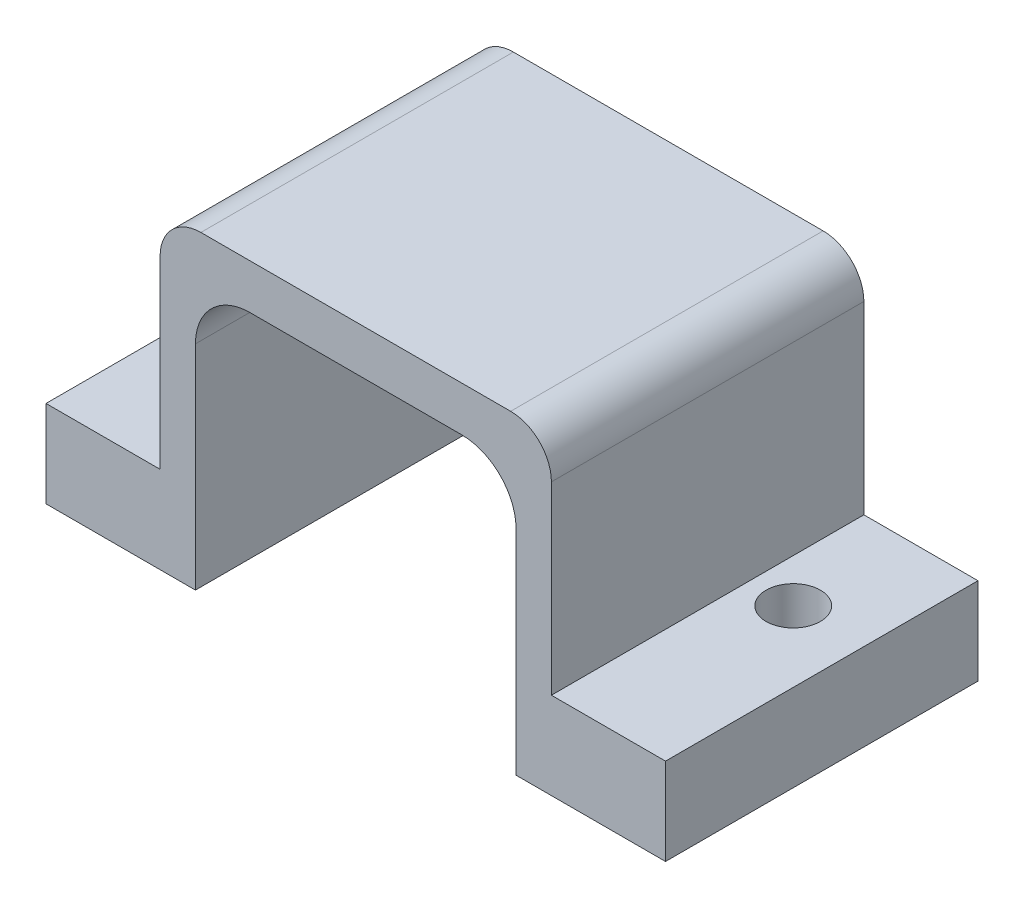
ISO-10303-21;
HEADER;
FILE_DESCRIPTION(('STEP AP214'),'2;1');
FILE_NAME('part.step','',(''),(''),'','','');
FILE_SCHEMA(('AUTOMOTIVE_DESIGN { 1 0 10303 214 1 1 1 1 }'));
ENDSEC;
DATA;
#1=APPLICATION_CONTEXT('core data for automotive mechanical design processes');
#2=APPLICATION_PROTOCOL_DEFINITION('international standard','automotive_design',2000,#1);
#3=PRODUCT_CONTEXT('',#1,'mechanical');
#4=PRODUCT('Part','Part','',(#3));
#5=PRODUCT_RELATED_PRODUCT_CATEGORY('part','',(#4));
#6=PRODUCT_DEFINITION_FORMATION('','',#4);
#7=PRODUCT_DEFINITION_CONTEXT('part definition',#1,'design');
#8=PRODUCT_DEFINITION('design','',#6,#7);
#9=PRODUCT_DEFINITION_SHAPE('','',#8);
#10=(LENGTH_UNIT() NAMED_UNIT(*) SI_UNIT(.MILLI.,.METRE.));
#11=(NAMED_UNIT(*) PLANE_ANGLE_UNIT() SI_UNIT($,.RADIAN.));
#12=(NAMED_UNIT(*) SI_UNIT($,.STERADIAN.) SOLID_ANGLE_UNIT());
#13=UNCERTAINTY_MEASURE_WITH_UNIT(LENGTH_MEASURE(1.E-05),#10,'distance_accuracy_value','');
#14=(GEOMETRIC_REPRESENTATION_CONTEXT(3) GLOBAL_UNCERTAINTY_ASSIGNED_CONTEXT((#13)) GLOBAL_UNIT_ASSIGNED_CONTEXT((#10,
#11,#12)) REPRESENTATION_CONTEXT('',''));
#15=CARTESIAN_POINT('',(0.,0.,0.));
#16=DIRECTION('',(0.,0.,1.));
#17=DIRECTION('',(1.,0.,0.));
#18=AXIS2_PLACEMENT_3D('',#15,#16,#17);
#19=CARTESIAN_POINT('',(-5.5,0.,11.5));
#20=DIRECTION('',(0.,1.,0.));
#21=DIRECTION('',(0.,0.,1.));
#22=AXIS2_PLACEMENT_3D('',#19,#20,#21);
#23=PLANE('',#22);
#24=CARTESIAN_POINT('',(-2.9,0.,4.2));
#25=DIRECTION('',(0.,1.,0.));
#26=DIRECTION('',(0.,0.,1.));
#27=AXIS2_PLACEMENT_3D('',#24,#25,#26);
#28=CIRCLE('',#27,1.);
#29=CARTESIAN_POINT('',(-2.9,0.,5.2));
#30=VERTEX_POINT('',#29);
#31=EDGE_CURVE('E294',#30,#30,#28,.T.);
#32=ORIENTED_EDGE('',*,*,#31,.T.);
#33=EDGE_LOOP('',(#32));
#34=FACE_BOUND('',#33,.T.);
#35=DIRECTION('',(1.,0.,0.));
#36=VECTOR('',#35,1.);
#37=CARTESIAN_POINT('',(-5.5,0.,0.));
#38=LINE('',#37,#36);
#39=CARTESIAN_POINT('',(-5.5,0.,0.));
#40=VERTEX_POINT('',#39);
#41=CARTESIAN_POINT('',(0.,0.,0.));
#42=VERTEX_POINT('',#41);
#43=EDGE_CURVE('E172',#40,#42,#38,.T.);
#44=ORIENTED_EDGE('',*,*,#43,.T.);
#45=DIRECTION('',(0.,0.,-1.));
#46=VECTOR('',#45,1.);
#47=CARTESIAN_POINT('',(0.,0.,11.5));
#48=LINE('',#47,#46);
#49=CARTESIAN_POINT('',(0.,0.,11.5));
#50=VERTEX_POINT('',#49);
#51=EDGE_CURVE('E154',#50,#42,#48,.T.);
#52=ORIENTED_EDGE('',*,*,#51,.F.);
#53=DIRECTION('',(1.,0.,0.));
#54=VECTOR('',#53,1.);
#55=CARTESIAN_POINT('',(-5.5,0.,11.5));
#56=LINE('',#55,#54);
#57=CARTESIAN_POINT('',(-5.5,0.,11.5));
#58=VERTEX_POINT('',#57);
#59=EDGE_CURVE('E160',#58,#50,#56,.T.);
#60=ORIENTED_EDGE('',*,*,#59,.F.);
#61=DIRECTION('',(0.,0.,-1.));
#62=VECTOR('',#61,1.);
#63=CARTESIAN_POINT('',(-5.5,0.,11.5));
#64=LINE('',#63,#62);
#65=EDGE_CURVE('E243',#58,#40,#64,.T.);
#66=ORIENTED_EDGE('',*,*,#65,.T.);
#67=EDGE_LOOP('',(#44,#52,#60,#66));
#68=FACE_BOUND('',#67,.T.);
#69=ADVANCED_FACE('F33',(#34,#68),#23,.F.);
#70=CARTESIAN_POINT('',(0.,0.,11.5));
#71=DIRECTION('',(-1.,0.,0.));
#72=DIRECTION('',(0.,0.,1.));
#73=AXIS2_PLACEMENT_3D('',#70,#71,#72);
#74=PLANE('',#73);
#75=DIRECTION('',(0.,1.,0.));
#76=VECTOR('',#75,1.);
#77=CARTESIAN_POINT('',(0.,0.,0.));
#78=LINE('',#77,#76);
#79=CARTESIAN_POINT('',(0.,7.85,0.));
#80=VERTEX_POINT('',#79);
#81=EDGE_CURVE('E274',#42,#80,#78,.T.);
#82=ORIENTED_EDGE('',*,*,#81,.T.);
#83=DIRECTION('',(0.,0.,-1.));
#84=VECTOR('',#83,1.);
#85=CARTESIAN_POINT('',(0.,7.85,11.5));
#86=LINE('',#85,#84);
#87=CARTESIAN_POINT('',(0.,7.85,11.5));
#88=VERTEX_POINT('',#87);
#89=EDGE_CURVE('E157',#80,#88,#86,.F.);
#90=ORIENTED_EDGE('',*,*,#89,.T.);
#91=DIRECTION('',(0.,1.,0.));
#92=VECTOR('',#91,1.);
#93=CARTESIAN_POINT('',(0.,0.,11.5));
#94=LINE('',#93,#92);
#95=EDGE_CURVE('E149',#50,#88,#94,.T.);
#96=ORIENTED_EDGE('',*,*,#95,.F.);
#97=ORIENTED_EDGE('',*,*,#51,.T.);
#98=EDGE_LOOP('',(#82,#90,#96,#97));
#99=FACE_BOUND('',#98,.T.);
#100=ADVANCED_FACE('F152',(#99),#74,.F.);
#101=CARTESIAN_POINT('',(0.,9.85,11.5));
#102=DIRECTION('',(0.,1.,0.));
#103=DIRECTION('',(0.,0.,1.));
#104=AXIS2_PLACEMENT_3D('',#101,#102,#103);
#105=PLANE('',#104);
#106=DIRECTION('',(1.,0.,0.));
#107=VECTOR('',#106,1.);
#108=CARTESIAN_POINT('',(0.,9.85,0.));
#109=LINE('',#108,#107);
#110=CARTESIAN_POINT('',(2.,9.85,0.));
#111=VERTEX_POINT('',#110);
#112=CARTESIAN_POINT('',(9.8,9.85,0.));
#113=VERTEX_POINT('',#112);
#114=EDGE_CURVE('E271',#111,#113,#109,.T.);
#115=ORIENTED_EDGE('',*,*,#114,.T.);
#116=DIRECTION('',(0.,0.,-1.));
#117=VECTOR('',#116,1.);
#118=CARTESIAN_POINT('',(9.8,9.85,11.5));
#119=LINE('',#118,#117);
#120=CARTESIAN_POINT('',(9.8,9.85,11.5));
#121=VERTEX_POINT('',#120);
#122=EDGE_CURVE('E186',#113,#121,#119,.F.);
#123=ORIENTED_EDGE('',*,*,#122,.T.);
#124=DIRECTION('',(1.,0.,0.));
#125=VECTOR('',#124,1.);
#126=CARTESIAN_POINT('',(0.,9.85,11.5));
#127=LINE('',#126,#125);
#128=CARTESIAN_POINT('',(2.,9.85,11.5));
#129=VERTEX_POINT('',#128);
#130=EDGE_CURVE('E159',#129,#121,#127,.T.);
#131=ORIENTED_EDGE('',*,*,#130,.F.);
#132=DIRECTION('',(0.,0.,-1.));
#133=VECTOR('',#132,1.);
#134=CARTESIAN_POINT('',(2.,9.85,0.));
#135=LINE('',#134,#133);
#136=EDGE_CURVE('E177',#129,#111,#135,.T.);
#137=ORIENTED_EDGE('',*,*,#136,.T.);
#138=EDGE_LOOP('',(#115,#123,#131,#137));
#139=FACE_BOUND('',#138,.T.);
#140=ADVANCED_FACE('F327',(#139),#105,.F.);
#141=CARTESIAN_POINT('',(11.8,9.85,11.5));
#142=DIRECTION('',(1.,0.,0.));
#143=DIRECTION('',(0.,0.,-1.));
#144=AXIS2_PLACEMENT_3D('',#141,#142,#143);
#145=PLANE('',#144);
#146=DIRECTION('',(0.,-1.,0.));
#147=VECTOR('',#146,1.);
#148=CARTESIAN_POINT('',(11.8,9.85,11.5));
#149=LINE('',#148,#147);
#150=CARTESIAN_POINT('',(11.8,7.85,11.5));
#151=VERTEX_POINT('',#150);
#152=CARTESIAN_POINT('',(11.8,0.,11.5));
#153=VERTEX_POINT('',#152);
#154=EDGE_CURVE('E288',#151,#153,#149,.T.);
#155=ORIENTED_EDGE('',*,*,#154,.F.);
#156=DIRECTION('',(0.,0.,-1.));
#157=VECTOR('',#156,1.);
#158=CARTESIAN_POINT('',(11.8,7.85,0.));
#159=LINE('',#158,#157);
#160=CARTESIAN_POINT('',(11.8,7.85,0.));
#161=VERTEX_POINT('',#160);
#162=EDGE_CURVE('E173',#151,#161,#159,.T.);
#163=ORIENTED_EDGE('',*,*,#162,.T.);
#164=DIRECTION('',(0.,-1.,0.));
#165=VECTOR('',#164,1.);
#166=CARTESIAN_POINT('',(11.8,9.85,0.));
#167=LINE('',#166,#165);
#168=CARTESIAN_POINT('',(11.8,0.,0.));
#169=VERTEX_POINT('',#168);
#170=EDGE_CURVE('E267',#161,#169,#167,.T.);
#171=ORIENTED_EDGE('',*,*,#170,.T.);
#172=DIRECTION('',(0.,0.,-1.));
#173=VECTOR('',#172,1.);
#174=CARTESIAN_POINT('',(11.8,0.,11.5));
#175=LINE('',#174,#173);
#176=EDGE_CURVE('E174',#153,#169,#175,.T.);
#177=ORIENTED_EDGE('',*,*,#176,.F.);
#178=EDGE_LOOP('',(#155,#163,#171,#177));
#179=FACE_BOUND('',#178,.T.);
#180=ADVANCED_FACE('F335',(#179),#145,.F.);
#181=CARTESIAN_POINT('',(11.8,0.,11.5));
#182=DIRECTION('',(0.,1.,0.));
#183=DIRECTION('',(0.,0.,1.));
#184=AXIS2_PLACEMENT_3D('',#181,#182,#183);
#185=PLANE('',#184);
#186=CARTESIAN_POINT('',(14.7,0.,4.2));
#187=DIRECTION('',(0.,1.,0.));
#188=DIRECTION('',(0.,0.,1.));
#189=AXIS2_PLACEMENT_3D('',#186,#187,#188);
#190=CIRCLE('',#189,1.);
#191=CARTESIAN_POINT('',(14.7,0.,5.2));
#192=VERTEX_POINT('',#191);
#193=EDGE_CURVE('E277',#192,#192,#190,.T.);
#194=ORIENTED_EDGE('',*,*,#193,.T.);
#195=EDGE_LOOP('',(#194));
#196=FACE_BOUND('',#195,.T.);
#197=DIRECTION('',(1.,0.,0.));
#198=VECTOR('',#197,1.);
#199=CARTESIAN_POINT('',(11.8,0.,0.));
#200=LINE('',#199,#198);
#201=CARTESIAN_POINT('',(17.3,0.,0.));
#202=VERTEX_POINT('',#201);
#203=EDGE_CURVE('E266',#169,#202,#200,.T.);
#204=ORIENTED_EDGE('',*,*,#203,.T.);
#205=DIRECTION('',(0.,0.,-1.));
#206=VECTOR('',#205,1.);
#207=CARTESIAN_POINT('',(17.3,0.,11.5));
#208=LINE('',#207,#206);
#209=CARTESIAN_POINT('',(17.3,0.,11.5));
#210=VERTEX_POINT('',#209);
#211=EDGE_CURVE('E180',#210,#202,#208,.T.);
#212=ORIENTED_EDGE('',*,*,#211,.F.);
#213=DIRECTION('',(1.,0.,0.));
#214=VECTOR('',#213,1.);
#215=CARTESIAN_POINT('',(11.8,0.,11.5));
#216=LINE('',#215,#214);
#217=EDGE_CURVE('E286',#153,#210,#216,.T.);
#218=ORIENTED_EDGE('',*,*,#217,.F.);
#219=ORIENTED_EDGE('',*,*,#176,.T.);
#220=EDGE_LOOP('',(#204,#212,#218,#219));
#221=FACE_BOUND('',#220,.T.);
#222=ADVANCED_FACE('F336',(#196,#221),#185,.F.);
#223=CARTESIAN_POINT('',(17.3,0.,11.5));
#224=DIRECTION('',(-1.,0.,0.));
#225=DIRECTION('',(0.,0.,1.));
#226=AXIS2_PLACEMENT_3D('',#223,#224,#225);
#227=PLANE('',#226);
#228=DIRECTION('',(0.,1.,0.));
#229=VECTOR('',#228,1.);
#230=CARTESIAN_POINT('',(17.3,0.,0.));
#231=LINE('',#230,#229);
#232=CARTESIAN_POINT('',(17.3,3.2,0.));
#233=VERTEX_POINT('',#232);
#234=EDGE_CURVE('E235',#202,#233,#231,.T.);
#235=ORIENTED_EDGE('',*,*,#234,.T.);
#236=DIRECTION('',(0.,0.,-1.));
#237=VECTOR('',#236,1.);
#238=CARTESIAN_POINT('',(17.3,3.2,11.5));
#239=LINE('',#238,#237);
#240=CARTESIAN_POINT('',(17.3,3.2,11.5));
#241=VERTEX_POINT('',#240);
#242=EDGE_CURVE('E252',#241,#233,#239,.T.);
#243=ORIENTED_EDGE('',*,*,#242,.F.);
#244=DIRECTION('',(0.,1.,0.));
#245=VECTOR('',#244,1.);
#246=CARTESIAN_POINT('',(17.3,0.,11.5));
#247=LINE('',#246,#245);
#248=EDGE_CURVE('E261',#210,#241,#247,.T.);
#249=ORIENTED_EDGE('',*,*,#248,.F.);
#250=ORIENTED_EDGE('',*,*,#211,.T.);
#251=EDGE_LOOP('',(#235,#243,#249,#250));
#252=FACE_BOUND('',#251,.T.);
#253=ADVANCED_FACE('F259',(#252),#227,.F.);
#254=CARTESIAN_POINT('',(17.3,3.2,11.5));
#255=DIRECTION('',(0.,-1.,0.));
#256=DIRECTION('',(1.,0.,0.));
#257=AXIS2_PLACEMENT_3D('',#254,#255,#256);
#258=PLANE('',#257);
#259=CARTESIAN_POINT('',(14.7,3.2,4.2));
#260=DIRECTION('',(0.,1.,0.));
#261=DIRECTION('',(-1.,0.,0.));
#262=AXIS2_PLACEMENT_3D('',#259,#260,#261);
#263=CIRCLE('',#262,1.);
#264=CARTESIAN_POINT('',(13.7,3.2,4.2));
#265=VERTEX_POINT('',#264);
#266=EDGE_CURVE('E298',#265,#265,#263,.T.);
#267=ORIENTED_EDGE('',*,*,#266,.F.);
#268=EDGE_LOOP('',(#267));
#269=FACE_BOUND('',#268,.T.);
#270=DIRECTION('',(-1.,0.,0.));
#271=VECTOR('',#270,1.);
#272=CARTESIAN_POINT('',(17.3,3.2,0.));
#273=LINE('',#272,#271);
#274=CARTESIAN_POINT('',(13.1,3.2,0.));
#275=VERTEX_POINT('',#274);
#276=EDGE_CURVE('E231',#233,#275,#273,.T.);
#277=ORIENTED_EDGE('',*,*,#276,.T.);
#278=DIRECTION('',(0.,0.,-1.));
#279=VECTOR('',#278,1.);
#280=CARTESIAN_POINT('',(13.1,3.2,11.5));
#281=LINE('',#280,#279);
#282=CARTESIAN_POINT('',(13.1,3.2,11.5));
#283=VERTEX_POINT('',#282);
#284=EDGE_CURVE('E230',#283,#275,#281,.T.);
#285=ORIENTED_EDGE('',*,*,#284,.F.);
#286=DIRECTION('',(-1.,0.,0.));
#287=VECTOR('',#286,1.);
#288=CARTESIAN_POINT('',(17.3,3.2,11.5));
#289=LINE('',#288,#287);
#290=EDGE_CURVE('E283',#241,#283,#289,.T.);
#291=ORIENTED_EDGE('',*,*,#290,.F.);
#292=ORIENTED_EDGE('',*,*,#242,.T.);
#293=EDGE_LOOP('',(#277,#285,#291,#292));
#294=FACE_BOUND('',#293,.T.);
#295=ADVANCED_FACE('F339',(#269,#294),#258,.F.);
#296=CARTESIAN_POINT('',(13.1,3.2,11.5));
#297=DIRECTION('',(-1.,0.,0.));
#298=DIRECTION('',(0.,0.,1.));
#299=AXIS2_PLACEMENT_3D('',#296,#297,#298);
#300=PLANE('',#299);
#301=DIRECTION('',(0.,1.,0.));
#302=VECTOR('',#301,1.);
#303=CARTESIAN_POINT('',(13.1,3.2,0.));
#304=LINE('',#303,#302);
#305=CARTESIAN_POINT('',(13.1,10.,0.));
#306=VERTEX_POINT('',#305);
#307=EDGE_CURVE('E225',#275,#306,#304,.T.);
#308=ORIENTED_EDGE('',*,*,#307,.T.);
#309=DIRECTION('',(0.,0.,-1.));
#310=VECTOR('',#309,1.);
#311=CARTESIAN_POINT('',(13.1,10.,11.5));
#312=LINE('',#311,#310);
#313=CARTESIAN_POINT('',(13.1,10.,11.5));
#314=VERTEX_POINT('',#313);
#315=EDGE_CURVE('E56',#306,#314,#312,.F.);
#316=ORIENTED_EDGE('',*,*,#315,.T.);
#317=DIRECTION('',(0.,1.,0.));
#318=VECTOR('',#317,1.);
#319=CARTESIAN_POINT('',(13.1,3.2,11.5));
#320=LINE('',#319,#318);
#321=EDGE_CURVE('E210',#283,#314,#320,.T.);
#322=ORIENTED_EDGE('',*,*,#321,.F.);
#323=ORIENTED_EDGE('',*,*,#284,.T.);
#324=EDGE_LOOP('',(#308,#316,#322,#323));
#325=FACE_BOUND('',#324,.T.);
#326=ADVANCED_FACE('F228',(#325),#300,.F.);
#327=CARTESIAN_POINT('',(13.1,11.5,11.5));
#328=DIRECTION('',(0.,-1.,0.));
#329=DIRECTION('',(1.,0.,0.));
#330=AXIS2_PLACEMENT_3D('',#327,#328,#329);
#331=PLANE('',#330);
#332=DIRECTION('',(-1.,0.,0.));
#333=VECTOR('',#332,1.);
#334=CARTESIAN_POINT('',(13.1,11.5,11.5));
#335=LINE('',#334,#333);
#336=CARTESIAN_POINT('',(11.6,11.5,11.5));
#337=VERTEX_POINT('',#336);
#338=CARTESIAN_POINT('',(0.199999999999999,11.5,11.5));
#339=VERTEX_POINT('',#338);
#340=EDGE_CURVE('E209',#337,#339,#335,.T.);
#341=ORIENTED_EDGE('',*,*,#340,.F.);
#342=DIRECTION('',(0.,0.,-1.));
#343=VECTOR('',#342,1.);
#344=CARTESIAN_POINT('',(11.6,11.5,11.5));
#345=LINE('',#344,#343);
#346=CARTESIAN_POINT('',(11.6,11.5,0.));
#347=VERTEX_POINT('',#346);
#348=EDGE_CURVE('E199',#337,#347,#345,.T.);
#349=ORIENTED_EDGE('',*,*,#348,.T.);
#350=DIRECTION('',(-1.,0.,0.));
#351=VECTOR('',#350,1.);
#352=CARTESIAN_POINT('',(13.1,11.5,0.));
#353=LINE('',#352,#351);
#354=CARTESIAN_POINT('',(0.199999999999999,11.5,0.));
#355=VERTEX_POINT('',#354);
#356=EDGE_CURVE('E226',#347,#355,#353,.T.);
#357=ORIENTED_EDGE('',*,*,#356,.T.);
#358=DIRECTION('',(0.,0.,-1.));
#359=VECTOR('',#358,1.);
#360=CARTESIAN_POINT('',(0.199999999999999,11.5,11.5));
#361=LINE('',#360,#359);
#362=EDGE_CURVE('E197',#355,#339,#361,.F.);
#363=ORIENTED_EDGE('',*,*,#362,.T.);
#364=EDGE_LOOP('',(#341,#349,#357,#363));
#365=FACE_BOUND('',#364,.T.);
#366=ADVANCED_FACE('F214',(#365),#331,.F.);
#367=CARTESIAN_POINT('',(-1.3,11.5,11.5));
#368=DIRECTION('',(1.,0.,0.));
#369=DIRECTION('',(0.,1.,0.));
#370=AXIS2_PLACEMENT_3D('',#367,#368,#369);
#371=PLANE('',#370);
#372=DIRECTION('',(0.,-1.,0.));
#373=VECTOR('',#372,1.);
#374=CARTESIAN_POINT('',(-1.3,11.5,11.5));
#375=LINE('',#374,#373);
#376=CARTESIAN_POINT('',(-1.3,10.,11.5));
#377=VERTEX_POINT('',#376);
#378=CARTESIAN_POINT('',(-1.3,3.2,11.5));
#379=VERTEX_POINT('',#378);
#380=EDGE_CURVE('E218',#377,#379,#375,.T.);
#381=ORIENTED_EDGE('',*,*,#380,.F.);
#382=DIRECTION('',(0.,0.,-1.));
#383=VECTOR('',#382,1.);
#384=CARTESIAN_POINT('',(-1.3,10.,11.5));
#385=LINE('',#384,#383);
#386=CARTESIAN_POINT('',(-1.3,10.,0.));
#387=VERTEX_POINT('',#386);
#388=EDGE_CURVE('E11',#377,#387,#385,.T.);
#389=ORIENTED_EDGE('',*,*,#388,.T.);
#390=DIRECTION('',(0.,-1.,0.));
#391=VECTOR('',#390,1.);
#392=CARTESIAN_POINT('',(-1.3,11.5,0.));
#393=LINE('',#392,#391);
#394=CARTESIAN_POINT('',(-1.3,3.2,0.));
#395=VERTEX_POINT('',#394);
#396=EDGE_CURVE('E233',#387,#395,#393,.T.);
#397=ORIENTED_EDGE('',*,*,#396,.T.);
#398=DIRECTION('',(0.,0.,-1.));
#399=VECTOR('',#398,1.);
#400=CARTESIAN_POINT('',(-1.3,3.2,11.5));
#401=LINE('',#400,#399);
#402=EDGE_CURVE('E248',#379,#395,#401,.T.);
#403=ORIENTED_EDGE('',*,*,#402,.F.);
#404=EDGE_LOOP('',(#381,#389,#397,#403));
#405=FACE_BOUND('',#404,.T.);
#406=ADVANCED_FACE('F311',(#405),#371,.F.);
#407=CARTESIAN_POINT('',(-1.3,3.2,11.5));
#408=DIRECTION('',(0.,-1.,0.));
#409=DIRECTION('',(1.,0.,0.));
#410=AXIS2_PLACEMENT_3D('',#407,#408,#409);
#411=PLANE('',#410);
#412=CARTESIAN_POINT('',(-2.9,3.2,4.2));
#413=DIRECTION('',(0.,1.,0.));
#414=DIRECTION('',(-1.,0.,0.));
#415=AXIS2_PLACEMENT_3D('',#412,#413,#414);
#416=CIRCLE('',#415,1.);
#417=CARTESIAN_POINT('',(-3.9,3.2,4.2));
#418=VERTEX_POINT('',#417);
#419=EDGE_CURVE('E297',#418,#418,#416,.T.);
#420=ORIENTED_EDGE('',*,*,#419,.F.);
#421=EDGE_LOOP('',(#420));
#422=FACE_BOUND('',#421,.T.);
#423=DIRECTION('',(-1.,0.,0.));
#424=VECTOR('',#423,1.);
#425=CARTESIAN_POINT('',(-1.3,3.2,0.));
#426=LINE('',#425,#424);
#427=CARTESIAN_POINT('',(-5.5,3.2,0.));
#428=VERTEX_POINT('',#427);
#429=EDGE_CURVE('E240',#395,#428,#426,.T.);
#430=ORIENTED_EDGE('',*,*,#429,.T.);
#431=DIRECTION('',(0.,0.,-1.));
#432=VECTOR('',#431,1.);
#433=CARTESIAN_POINT('',(-5.5,3.2,11.5));
#434=LINE('',#433,#432);
#435=CARTESIAN_POINT('',(-5.5,3.2,11.5));
#436=VERTEX_POINT('',#435);
#437=EDGE_CURVE('E245',#436,#428,#434,.T.);
#438=ORIENTED_EDGE('',*,*,#437,.F.);
#439=DIRECTION('',(-1.,0.,0.));
#440=VECTOR('',#439,1.);
#441=CARTESIAN_POINT('',(-1.3,3.2,11.5));
#442=LINE('',#441,#440);
#443=EDGE_CURVE('E279',#379,#436,#442,.T.);
#444=ORIENTED_EDGE('',*,*,#443,.F.);
#445=ORIENTED_EDGE('',*,*,#402,.T.);
#446=EDGE_LOOP('',(#430,#438,#444,#445));
#447=FACE_BOUND('',#446,.T.);
#448=ADVANCED_FACE('F307',(#422,#447),#411,.F.);
#449=CARTESIAN_POINT('',(-5.5,3.2,11.5));
#450=DIRECTION('',(1.,0.,0.));
#451=DIRECTION('',(0.,0.,-1.));
#452=AXIS2_PLACEMENT_3D('',#449,#450,#451);
#453=PLANE('',#452);
#454=DIRECTION('',(0.,-1.,0.));
#455=VECTOR('',#454,1.);
#456=CARTESIAN_POINT('',(-5.5,3.2,0.));
#457=LINE('',#456,#455);
#458=EDGE_CURVE('E169',#428,#40,#457,.T.);
#459=ORIENTED_EDGE('',*,*,#458,.T.);
#460=ORIENTED_EDGE('',*,*,#65,.F.);
#461=DIRECTION('',(0.,-1.,0.));
#462=VECTOR('',#461,1.);
#463=CARTESIAN_POINT('',(-5.5,3.2,11.5));
#464=LINE('',#463,#462);
#465=EDGE_CURVE('E165',#436,#58,#464,.T.);
#466=ORIENTED_EDGE('',*,*,#465,.F.);
#467=ORIENTED_EDGE('',*,*,#437,.T.);
#468=EDGE_LOOP('',(#459,#460,#466,#467));
#469=FACE_BOUND('',#468,.T.);
#470=ADVANCED_FACE('F310',(#469),#453,.F.);
#471=CARTESIAN_POINT('',(0.,0.,11.5));
#472=DIRECTION('',(0.,0.,1.));
#473=DIRECTION('',(1.,0.,0.));
#474=AXIS2_PLACEMENT_3D('',#471,#472,#473);
#475=PLANE('',#474);
#476=ORIENTED_EDGE('',*,*,#321,.T.);
#477=CARTESIAN_POINT('',(11.6,10.,11.5));
#478=DIRECTION('',(0.,0.,1.));
#479=DIRECTION('',(1.,0.,0.));
#480=AXIS2_PLACEMENT_3D('',#477,#478,#479);
#481=CIRCLE('',#480,1.5);
#482=EDGE_CURVE('E41',#314,#337,#481,.T.);
#483=ORIENTED_EDGE('',*,*,#482,.T.);
#484=ORIENTED_EDGE('',*,*,#340,.T.);
#485=CARTESIAN_POINT('',(0.2,10.,11.5));
#486=DIRECTION('',(0.,0.,1.));
#487=DIRECTION('',(1.,0.,0.));
#488=AXIS2_PLACEMENT_3D('',#485,#486,#487);
#489=CIRCLE('',#488,1.5);
#490=EDGE_CURVE('E48',#339,#377,#489,.T.);
#491=ORIENTED_EDGE('',*,*,#490,.T.);
#492=ORIENTED_EDGE('',*,*,#380,.T.);
#493=ORIENTED_EDGE('',*,*,#443,.T.);
#494=ORIENTED_EDGE('',*,*,#465,.T.);
#495=ORIENTED_EDGE('',*,*,#59,.T.);
#496=ORIENTED_EDGE('',*,*,#95,.T.);
#497=CARTESIAN_POINT('',(2.,7.85,11.5));
#498=DIRECTION('',(0.,0.,1.));
#499=DIRECTION('',(1.,0.,0.));
#500=AXIS2_PLACEMENT_3D('',#497,#498,#499);
#501=CIRCLE('',#500,2.);
#502=EDGE_CURVE('E195',#88,#129,#501,.F.);
#503=ORIENTED_EDGE('',*,*,#502,.T.);
#504=ORIENTED_EDGE('',*,*,#130,.T.);
#505=CARTESIAN_POINT('',(9.8,7.85,11.5));
#506=DIRECTION('',(0.,0.,1.));
#507=DIRECTION('',(1.,0.,0.));
#508=AXIS2_PLACEMENT_3D('',#505,#506,#507);
#509=CIRCLE('',#508,2.);
#510=EDGE_CURVE('E191',#121,#151,#509,.F.);
#511=ORIENTED_EDGE('',*,*,#510,.T.);
#512=ORIENTED_EDGE('',*,*,#154,.T.);
#513=ORIENTED_EDGE('',*,*,#217,.T.);
#514=ORIENTED_EDGE('',*,*,#248,.T.);
#515=ORIENTED_EDGE('',*,*,#290,.T.);
#516=EDGE_LOOP('',(#476,#483,#484,#491,#492,#493,#494,#495,#496,#503,#504,#511,#512,#513,#514,#515));
#517=FACE_BOUND('',#516,.T.);
#518=ADVANCED_FACE('F163',(#517),#475,.T.);
#519=CARTESIAN_POINT('',(0.,0.,0.));
#520=DIRECTION('',(0.,0.,1.));
#521=DIRECTION('',(1.,0.,0.));
#522=AXIS2_PLACEMENT_3D('',#519,#520,#521);
#523=PLANE('',#522);
#524=ORIENTED_EDGE('',*,*,#356,.F.);
#525=CARTESIAN_POINT('',(11.6,10.,0.));
#526=DIRECTION('',(0.,0.,1.));
#527=DIRECTION('',(1.,0.,0.));
#528=AXIS2_PLACEMENT_3D('',#525,#526,#527);
#529=CIRCLE('',#528,1.5);
#530=EDGE_CURVE('E204',#347,#306,#529,.F.);
#531=ORIENTED_EDGE('',*,*,#530,.T.);
#532=ORIENTED_EDGE('',*,*,#307,.F.);
#533=ORIENTED_EDGE('',*,*,#276,.F.);
#534=ORIENTED_EDGE('',*,*,#234,.F.);
#535=ORIENTED_EDGE('',*,*,#203,.F.);
#536=ORIENTED_EDGE('',*,*,#170,.F.);
#537=CARTESIAN_POINT('',(9.8,7.85,0.));
#538=DIRECTION('',(0.,0.,1.));
#539=DIRECTION('',(1.,0.,0.));
#540=AXIS2_PLACEMENT_3D('',#537,#538,#539);
#541=CIRCLE('',#540,2.);
#542=EDGE_CURVE('E189',#161,#113,#541,.T.);
#543=ORIENTED_EDGE('',*,*,#542,.T.);
#544=ORIENTED_EDGE('',*,*,#114,.F.);
#545=CARTESIAN_POINT('',(2.,7.85,0.));
#546=DIRECTION('',(0.,0.,1.));
#547=DIRECTION('',(1.,0.,0.));
#548=AXIS2_PLACEMENT_3D('',#545,#546,#547);
#549=CIRCLE('',#548,2.);
#550=EDGE_CURVE('E193',#111,#80,#549,.T.);
#551=ORIENTED_EDGE('',*,*,#550,.T.);
#552=ORIENTED_EDGE('',*,*,#81,.F.);
#553=ORIENTED_EDGE('',*,*,#43,.F.);
#554=ORIENTED_EDGE('',*,*,#458,.F.);
#555=ORIENTED_EDGE('',*,*,#429,.F.);
#556=ORIENTED_EDGE('',*,*,#396,.F.);
#557=CARTESIAN_POINT('',(0.2,10.,0.));
#558=DIRECTION('',(0.,0.,1.));
#559=DIRECTION('',(1.,0.,0.));
#560=AXIS2_PLACEMENT_3D('',#557,#558,#559);
#561=CIRCLE('',#560,1.5);
#562=EDGE_CURVE('E202',#387,#355,#561,.F.);
#563=ORIENTED_EDGE('',*,*,#562,.T.);
#564=EDGE_LOOP('',(#524,#531,#532,#533,#534,#535,#536,#543,#544,#551,#552,#553,#554,#555,#556,#563));
#565=FACE_BOUND('',#564,.T.);
#566=ADVANCED_FACE('F223',(#565),#523,.F.);
#567=CARTESIAN_POINT('',(9.8,7.85,11.5));
#568=DIRECTION('',(0.,0.,1.));
#569=DIRECTION('',(1.,0.,0.));
#570=AXIS2_PLACEMENT_3D('',#567,#568,#569);
#571=CYLINDRICAL_SURFACE('',#570,2.);
#572=ORIENTED_EDGE('',*,*,#510,.F.);
#573=ORIENTED_EDGE('',*,*,#122,.F.);
#574=ORIENTED_EDGE('',*,*,#542,.F.);
#575=ORIENTED_EDGE('',*,*,#162,.F.);
#576=EDGE_LOOP('',(#572,#573,#574,#575));
#577=FACE_BOUND('',#576,.T.);
#578=ADVANCED_FACE('F330',(#577),#571,.F.);
#579=CARTESIAN_POINT('',(2.,7.85,11.5));
#580=DIRECTION('',(0.,0.,1.));
#581=DIRECTION('',(1.,0.,0.));
#582=AXIS2_PLACEMENT_3D('',#579,#580,#581);
#583=CYLINDRICAL_SURFACE('',#582,2.);
#584=ORIENTED_EDGE('',*,*,#502,.F.);
#585=ORIENTED_EDGE('',*,*,#89,.F.);
#586=ORIENTED_EDGE('',*,*,#550,.F.);
#587=ORIENTED_EDGE('',*,*,#136,.F.);
#588=EDGE_LOOP('',(#584,#585,#586,#587));
#589=FACE_BOUND('',#588,.T.);
#590=ADVANCED_FACE('F322',(#589),#583,.F.);
#591=CARTESIAN_POINT('',(11.6,10.,11.5));
#592=DIRECTION('',(0.,0.,-1.));
#593=DIRECTION('',(-1.,0.,0.));
#594=AXIS2_PLACEMENT_3D('',#591,#592,#593);
#595=CYLINDRICAL_SURFACE('',#594,1.5);
#596=ORIENTED_EDGE('',*,*,#482,.F.);
#597=ORIENTED_EDGE('',*,*,#315,.F.);
#598=ORIENTED_EDGE('',*,*,#530,.F.);
#599=ORIENTED_EDGE('',*,*,#348,.F.);
#600=EDGE_LOOP('',(#596,#597,#598,#599));
#601=FACE_BOUND('',#600,.T.);
#602=ADVANCED_FACE('F220',(#601),#595,.T.);
#603=CARTESIAN_POINT('',(0.2,10.,11.5));
#604=DIRECTION('',(0.,0.,-1.));
#605=DIRECTION('',(-1.,0.,0.));
#606=AXIS2_PLACEMENT_3D('',#603,#604,#605);
#607=CYLINDRICAL_SURFACE('',#606,1.5);
#608=ORIENTED_EDGE('',*,*,#490,.F.);
#609=ORIENTED_EDGE('',*,*,#362,.F.);
#610=ORIENTED_EDGE('',*,*,#562,.F.);
#611=ORIENTED_EDGE('',*,*,#388,.F.);
#612=EDGE_LOOP('',(#608,#609,#610,#611));
#613=FACE_BOUND('',#612,.T.);
#614=ADVANCED_FACE('F35',(#613),#607,.T.);
#615=CARTESIAN_POINT('',(-2.9,-8.3,4.2));
#616=DIRECTION('',(0.,1.,0.));
#617=DIRECTION('',(-1.,0.,0.));
#618=AXIS2_PLACEMENT_3D('',#615,#616,#617);
#619=CYLINDRICAL_SURFACE('',#618,1.);
#620=ORIENTED_EDGE('',*,*,#419,.T.);
#621=EDGE_LOOP('',(#620));
#622=FACE_BOUND('',#621,.T.);
#623=ORIENTED_EDGE('',*,*,#31,.F.);
#624=EDGE_LOOP('',(#623));
#625=FACE_BOUND('',#624,.T.);
#626=ADVANCED_FACE('F304',(#622,#625),#619,.F.);
#627=CARTESIAN_POINT('',(14.7,-8.3,4.2));
#628=DIRECTION('',(0.,1.,0.));
#629=DIRECTION('',(-1.,0.,0.));
#630=AXIS2_PLACEMENT_3D('',#627,#628,#629);
#631=CYLINDRICAL_SURFACE('',#630,1.);
#632=ORIENTED_EDGE('',*,*,#266,.T.);
#633=EDGE_LOOP('',(#632));
#634=FACE_BOUND('',#633,.T.);
#635=ORIENTED_EDGE('',*,*,#193,.F.);
#636=EDGE_LOOP('',(#635));
#637=FACE_BOUND('',#636,.T.);
#638=ADVANCED_FACE('F370',(#634,#637),#631,.F.);
#639=CLOSED_SHELL('',(#69,#100,#140,#180,#222,#253,#295,#326,#366,#406,#448,#470,#518,#566,#578,
#590,#602,#614,#626,#638));
#640=MANIFOLD_SOLID_BREP('B2',#639);
#641=ADVANCED_BREP_SHAPE_REPRESENTATION('',(#18,#640),#14);
#642=SHAPE_DEFINITION_REPRESENTATION(#9,#641);
ENDSEC;
END-ISO-10303-21;
